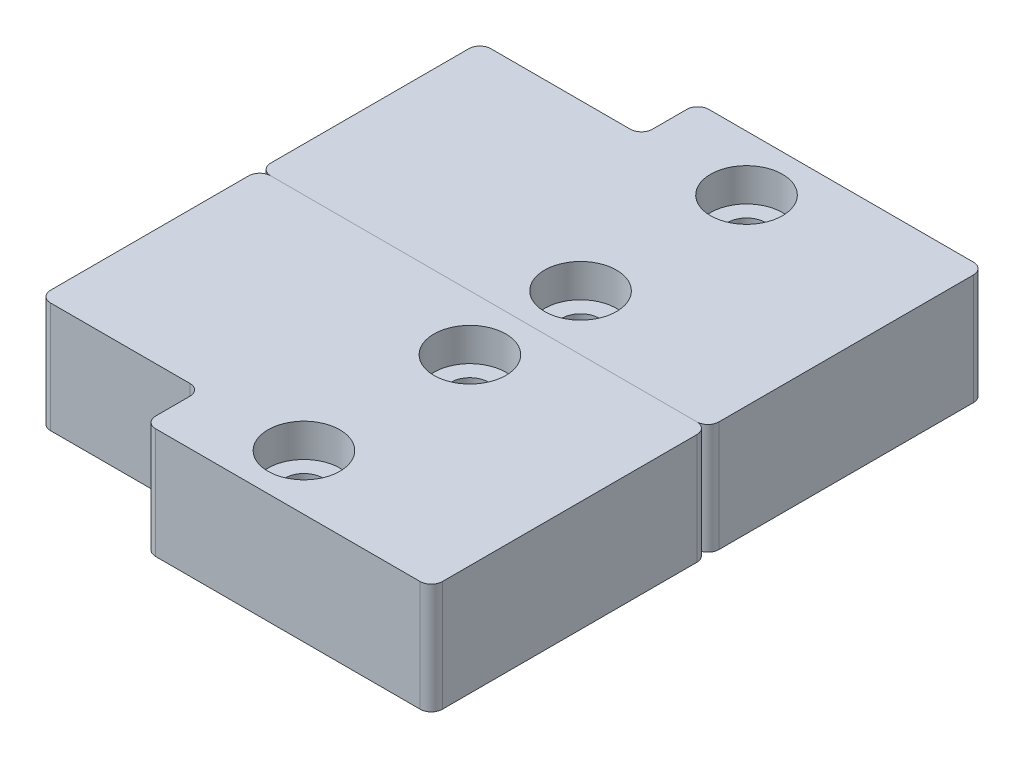
ISO-10303-21;
HEADER;
FILE_DESCRIPTION(('STEP AP214'),'2;1');
FILE_NAME('part.step','',(''),(''),'','','');
FILE_SCHEMA(('AUTOMOTIVE_DESIGN { 1 0 10303 214 1 1 1 1 }'));
ENDSEC;
DATA;
#1=APPLICATION_CONTEXT('core data for automotive mechanical design processes');
#2=APPLICATION_PROTOCOL_DEFINITION('international standard','automotive_design',2000,#1);
#3=PRODUCT_CONTEXT('',#1,'mechanical');
#4=PRODUCT('Part','Part','',(#3));
#5=PRODUCT_RELATED_PRODUCT_CATEGORY('part','',(#4));
#6=PRODUCT_DEFINITION_FORMATION('','',#4);
#7=PRODUCT_DEFINITION_CONTEXT('part definition',#1,'design');
#8=PRODUCT_DEFINITION('design','',#6,#7);
#9=PRODUCT_DEFINITION_SHAPE('','',#8);
#10=(LENGTH_UNIT() NAMED_UNIT(*) SI_UNIT(.MILLI.,.METRE.));
#11=(NAMED_UNIT(*) PLANE_ANGLE_UNIT() SI_UNIT($,.RADIAN.));
#12=(NAMED_UNIT(*) SI_UNIT($,.STERADIAN.) SOLID_ANGLE_UNIT());
#13=UNCERTAINTY_MEASURE_WITH_UNIT(LENGTH_MEASURE(1.E-05),#10,'distance_accuracy_value','');
#14=(GEOMETRIC_REPRESENTATION_CONTEXT(3) GLOBAL_UNCERTAINTY_ASSIGNED_CONTEXT((#13)) GLOBAL_UNIT_ASSIGNED_CONTEXT((#10,
#11,#12)) REPRESENTATION_CONTEXT('',''));
#15=CARTESIAN_POINT('',(0.,0.,0.));
#16=DIRECTION('',(0.,0.,1.));
#17=DIRECTION('',(1.,0.,0.));
#18=AXIS2_PLACEMENT_3D('',#15,#16,#17);
#19=CARTESIAN_POINT('',(0.,10.,19.9));
#20=DIRECTION('',(1.,0.,0.));
#21=DIRECTION('',(0.,0.,1.));
#22=AXIS2_PLACEMENT_3D('',#19,#20,#21);
#23=PLANE('',#22);
#24=DIRECTION('',(0.,0.,-1.));
#25=VECTOR('',#24,1.);
#26=CARTESIAN_POINT('',(0.,10.,19.9));
#27=LINE('',#26,#25);
#28=CARTESIAN_POINT('',(0.,10.,18.9));
#29=VERTEX_POINT('',#28);
#30=CARTESIAN_POINT('',(0.,10.,1.00000000000001));
#31=VERTEX_POINT('',#30);
#32=EDGE_CURVE('E188',#29,#31,#27,.T.);
#33=ORIENTED_EDGE('',*,*,#32,.T.);
#34=DIRECTION('',(0.,-1.,0.));
#35=VECTOR('',#34,1.);
#36=CARTESIAN_POINT('',(0.,10.,1.));
#37=LINE('',#36,#35);
#38=CARTESIAN_POINT('',(0.,0.,1.00000000000001));
#39=VERTEX_POINT('',#38);
#40=EDGE_CURVE('E163',#39,#31,#37,.F.);
#41=ORIENTED_EDGE('',*,*,#40,.F.);
#42=DIRECTION('',(0.,0.,-1.));
#43=VECTOR('',#42,1.);
#44=CARTESIAN_POINT('',(0.,0.,19.9));
#45=LINE('',#44,#43);
#46=CARTESIAN_POINT('',(0.,0.,18.9));
#47=VERTEX_POINT('',#46);
#48=EDGE_CURVE('E145',#47,#39,#45,.T.);
#49=ORIENTED_EDGE('',*,*,#48,.F.);
#50=DIRECTION('',(0.,-1.,0.));
#51=VECTOR('',#50,1.);
#52=CARTESIAN_POINT('',(0.,10.,18.9));
#53=LINE('',#52,#51);
#54=EDGE_CURVE('E156',#29,#47,#53,.T.);
#55=ORIENTED_EDGE('',*,*,#54,.F.);
#56=EDGE_LOOP('',(#33,#41,#49,#55));
#57=FACE_BOUND('',#56,.T.);
#58=ADVANCED_FACE('F53',(#57),#23,.F.);
#59=CARTESIAN_POINT('',(0.,10.,0.));
#60=DIRECTION('',(0.,0.,1.));
#61=DIRECTION('',(-1.,0.,0.));
#62=AXIS2_PLACEMENT_3D('',#59,#60,#61);
#63=PLANE('',#62);
#64=DIRECTION('',(1.,0.,0.));
#65=VECTOR('',#64,1.);
#66=CARTESIAN_POINT('',(0.,0.,0.));
#67=LINE('',#66,#65);
#68=CARTESIAN_POINT('',(1.,0.,0.));
#69=VERTEX_POINT('',#68);
#70=CARTESIAN_POINT('',(39.51,0.,0.));
#71=VERTEX_POINT('',#70);
#72=EDGE_CURVE('E166',#69,#71,#67,.T.);
#73=ORIENTED_EDGE('',*,*,#72,.F.);
#74=DIRECTION('',(0.,-1.,0.));
#75=VECTOR('',#74,1.);
#76=CARTESIAN_POINT('',(1.,10.,0.));
#77=LINE('',#76,#75);
#78=CARTESIAN_POINT('',(1.,10.,0.));
#79=VERTEX_POINT('',#78);
#80=EDGE_CURVE('E223',#79,#69,#77,.T.);
#81=ORIENTED_EDGE('',*,*,#80,.F.);
#82=DIRECTION('',(1.,0.,0.));
#83=VECTOR('',#82,1.);
#84=CARTESIAN_POINT('',(0.,10.,0.));
#85=LINE('',#84,#83);
#86=CARTESIAN_POINT('',(39.51,10.,0.));
#87=VERTEX_POINT('',#86);
#88=EDGE_CURVE('E305',#79,#87,#85,.T.);
#89=ORIENTED_EDGE('',*,*,#88,.T.);
#90=DIRECTION('',(0.,-1.,0.));
#91=VECTOR('',#90,1.);
#92=CARTESIAN_POINT('',(39.51,10.,0.));
#93=LINE('',#92,#91);
#94=EDGE_CURVE('E226',#71,#87,#93,.F.);
#95=ORIENTED_EDGE('',*,*,#94,.F.);
#96=EDGE_LOOP('',(#73,#81,#89,#95));
#97=FACE_BOUND('',#96,.T.);
#98=ADVANCED_FACE('F253',(#97),#63,.F.);
#99=CARTESIAN_POINT('',(40.51,10.,0.));
#100=DIRECTION('',(-1.,0.,0.));
#101=DIRECTION('',(0.,0.,-1.));
#102=AXIS2_PLACEMENT_3D('',#99,#100,#101);
#103=PLANE('',#102);
#104=DIRECTION('',(0.,0.,1.));
#105=VECTOR('',#104,1.);
#106=CARTESIAN_POINT('',(40.51,0.,0.));
#107=LINE('',#106,#105);
#108=CARTESIAN_POINT('',(40.51,0.,1.));
#109=VERTEX_POINT('',#108);
#110=CARTESIAN_POINT('',(40.51,0.,24.));
#111=VERTEX_POINT('',#110);
#112=EDGE_CURVE('E170',#109,#111,#107,.T.);
#113=ORIENTED_EDGE('',*,*,#112,.F.);
#114=DIRECTION('',(0.,-1.,0.));
#115=VECTOR('',#114,1.);
#116=CARTESIAN_POINT('',(40.51,10.,1.));
#117=LINE('',#116,#115);
#118=CARTESIAN_POINT('',(40.51,10.,1.));
#119=VERTEX_POINT('',#118);
#120=EDGE_CURVE('E217',#119,#109,#117,.T.);
#121=ORIENTED_EDGE('',*,*,#120,.F.);
#122=DIRECTION('',(0.,0.,1.));
#123=VECTOR('',#122,1.);
#124=CARTESIAN_POINT('',(40.51,10.,0.));
#125=LINE('',#124,#123);
#126=CARTESIAN_POINT('',(40.51,10.,24.));
#127=VERTEX_POINT('',#126);
#128=EDGE_CURVE('E302',#119,#127,#125,.T.);
#129=ORIENTED_EDGE('',*,*,#128,.T.);
#130=DIRECTION('',(0.,-1.,0.));
#131=VECTOR('',#130,1.);
#132=CARTESIAN_POINT('',(40.51,10.,24.));
#133=LINE('',#132,#131);
#134=EDGE_CURVE('E220',#111,#127,#133,.F.);
#135=ORIENTED_EDGE('',*,*,#134,.F.);
#136=EDGE_LOOP('',(#113,#121,#129,#135));
#137=FACE_BOUND('',#136,.T.);
#138=ADVANCED_FACE('F258',(#137),#103,.F.);
#139=CARTESIAN_POINT('',(40.51,10.,25.));
#140=DIRECTION('',(0.,0.,-1.));
#141=DIRECTION('',(1.,0.,0.));
#142=AXIS2_PLACEMENT_3D('',#139,#140,#141);
#143=PLANE('',#142);
#144=DIRECTION('',(-1.,0.,0.));
#145=VECTOR('',#144,1.);
#146=CARTESIAN_POINT('',(40.51,0.,25.));
#147=LINE('',#146,#145);
#148=CARTESIAN_POINT('',(39.51,0.,25.));
#149=VERTEX_POINT('',#148);
#150=CARTESIAN_POINT('',(15.6,0.,25.));
#151=VERTEX_POINT('',#150);
#152=EDGE_CURVE('E181',#149,#151,#147,.T.);
#153=ORIENTED_EDGE('',*,*,#152,.F.);
#154=DIRECTION('',(0.,-1.,0.));
#155=VECTOR('',#154,1.);
#156=CARTESIAN_POINT('',(39.51,10.,25.));
#157=LINE('',#156,#155);
#158=CARTESIAN_POINT('',(39.51,10.,25.));
#159=VERTEX_POINT('',#158);
#160=EDGE_CURVE('E212',#159,#149,#157,.T.);
#161=ORIENTED_EDGE('',*,*,#160,.F.);
#162=DIRECTION('',(-1.,0.,0.));
#163=VECTOR('',#162,1.);
#164=CARTESIAN_POINT('',(40.51,10.,25.));
#165=LINE('',#164,#163);
#166=CARTESIAN_POINT('',(15.6,10.,25.));
#167=VERTEX_POINT('',#166);
#168=EDGE_CURVE('E304',#159,#167,#165,.T.);
#169=ORIENTED_EDGE('',*,*,#168,.T.);
#170=DIRECTION('',(0.,-1.,0.));
#171=VECTOR('',#170,1.);
#172=CARTESIAN_POINT('',(15.6,10.,25.));
#173=LINE('',#172,#171);
#174=EDGE_CURVE('E215',#151,#167,#173,.F.);
#175=ORIENTED_EDGE('',*,*,#174,.F.);
#176=EDGE_LOOP('',(#153,#161,#169,#175));
#177=FACE_BOUND('',#176,.T.);
#178=ADVANCED_FACE('F285',(#177),#143,.F.);
#179=CARTESIAN_POINT('',(14.6,10.,25.));
#180=DIRECTION('',(1.,0.,0.));
#181=DIRECTION('',(0.,0.,1.));
#182=AXIS2_PLACEMENT_3D('',#179,#180,#181);
#183=PLANE('',#182);
#184=DIRECTION('',(0.,0.,-1.));
#185=VECTOR('',#184,1.);
#186=CARTESIAN_POINT('',(14.6,0.,25.));
#187=LINE('',#186,#185);
#188=CARTESIAN_POINT('',(14.6,0.,24.));
#189=VERTEX_POINT('',#188);
#190=CARTESIAN_POINT('',(14.6,0.,20.9));
#191=VERTEX_POINT('',#190);
#192=EDGE_CURVE('E184',#189,#191,#187,.T.);
#193=ORIENTED_EDGE('',*,*,#192,.F.);
#194=DIRECTION('',(0.,-1.,0.));
#195=VECTOR('',#194,1.);
#196=CARTESIAN_POINT('',(14.6,10.,24.));
#197=LINE('',#196,#195);
#198=CARTESIAN_POINT('',(14.6,10.,24.));
#199=VERTEX_POINT('',#198);
#200=EDGE_CURVE('E208',#199,#189,#197,.T.);
#201=ORIENTED_EDGE('',*,*,#200,.F.);
#202=DIRECTION('',(0.,0.,-1.));
#203=VECTOR('',#202,1.);
#204=CARTESIAN_POINT('',(14.6,10.,25.));
#205=LINE('',#204,#203);
#206=CARTESIAN_POINT('',(14.6,10.,20.9));
#207=VERTEX_POINT('',#206);
#208=EDGE_CURVE('E237',#199,#207,#205,.T.);
#209=ORIENTED_EDGE('',*,*,#208,.T.);
#210=DIRECTION('',(0.,-1.,0.));
#211=VECTOR('',#210,1.);
#212=CARTESIAN_POINT('',(14.6,10.,20.9));
#213=LINE('',#212,#211);
#214=EDGE_CURVE('E210',#191,#207,#213,.F.);
#215=ORIENTED_EDGE('',*,*,#214,.F.);
#216=EDGE_LOOP('',(#193,#201,#209,#215));
#217=FACE_BOUND('',#216,.T.);
#218=ADVANCED_FACE('F235',(#217),#183,.F.);
#219=CARTESIAN_POINT('',(14.6,10.,19.9));
#220=DIRECTION('',(0.,0.,-1.));
#221=DIRECTION('',(1.,0.,0.));
#222=AXIS2_PLACEMENT_3D('',#219,#220,#221);
#223=PLANE('',#222);
#224=DIRECTION('',(-1.,0.,0.));
#225=VECTOR('',#224,1.);
#226=CARTESIAN_POINT('',(14.6,0.,19.9));
#227=LINE('',#226,#225);
#228=CARTESIAN_POINT('',(13.6,0.,19.9));
#229=VERTEX_POINT('',#228);
#230=CARTESIAN_POINT('',(0.999999999999997,0.,19.9));
#231=VERTEX_POINT('',#230);
#232=EDGE_CURVE('E148',#229,#231,#227,.T.);
#233=ORIENTED_EDGE('',*,*,#232,.F.);
#234=DIRECTION('',(0.,-1.,0.));
#235=VECTOR('',#234,1.);
#236=CARTESIAN_POINT('',(13.6,0.,19.9));
#237=LINE('',#236,#235);
#238=CARTESIAN_POINT('',(13.6,10.,19.9));
#239=VERTEX_POINT('',#238);
#240=EDGE_CURVE('E152',#239,#229,#237,.T.);
#241=ORIENTED_EDGE('',*,*,#240,.F.);
#242=DIRECTION('',(-1.,0.,0.));
#243=VECTOR('',#242,1.);
#244=CARTESIAN_POINT('',(14.6,10.,19.9));
#245=LINE('',#244,#243);
#246=CARTESIAN_POINT('',(0.999999999999997,10.,19.9));
#247=VERTEX_POINT('',#246);
#248=EDGE_CURVE('E176',#239,#247,#245,.T.);
#249=ORIENTED_EDGE('',*,*,#248,.T.);
#250=DIRECTION('',(0.,-1.,0.));
#251=VECTOR('',#250,1.);
#252=CARTESIAN_POINT('',(0.999999999999997,10.,19.9));
#253=LINE('',#252,#251);
#254=EDGE_CURVE('E198',#231,#247,#253,.F.);
#255=ORIENTED_EDGE('',*,*,#254,.F.);
#256=EDGE_LOOP('',(#233,#241,#249,#255));
#257=FACE_BOUND('',#256,.T.);
#258=ADVANCED_FACE('F273',(#257),#223,.F.);
#259=CARTESIAN_POINT('',(0.,10.,0.));
#260=DIRECTION('',(0.,1.,0.));
#261=DIRECTION('',(0.,0.,-1.));
#262=AXIS2_PLACEMENT_3D('',#259,#260,#261);
#263=PLANE('',#262);
#264=CARTESIAN_POINT('',(24.,10.,20.));
#265=DIRECTION('',(0.,-1.,0.));
#266=DIRECTION('',(0.,0.,-1.));
#267=AXIS2_PLACEMENT_3D('',#264,#265,#266);
#268=CIRCLE('',#267,3.25);
#269=CARTESIAN_POINT('',(24.,10.,16.75));
#270=VERTEX_POINT('',#269);
#271=EDGE_CURVE('E330',#270,#270,#268,.T.);
#272=ORIENTED_EDGE('',*,*,#271,.T.);
#273=EDGE_LOOP('',(#272));
#274=FACE_BOUND('',#273,.T.);
#275=CARTESIAN_POINT('',(24.,10.,5.));
#276=DIRECTION('',(0.,-1.,0.));
#277=DIRECTION('',(0.,0.,-1.));
#278=AXIS2_PLACEMENT_3D('',#275,#276,#277);
#279=CIRCLE('',#278,3.25);
#280=CARTESIAN_POINT('',(24.,10.,1.75000000000001));
#281=VERTEX_POINT('',#280);
#282=EDGE_CURVE('E318',#281,#281,#279,.T.);
#283=ORIENTED_EDGE('',*,*,#282,.T.);
#284=EDGE_LOOP('',(#283));
#285=FACE_BOUND('',#284,.T.);
#286=ORIENTED_EDGE('',*,*,#248,.F.);
#287=CARTESIAN_POINT('',(13.6,10.,20.9));
#288=DIRECTION('',(0.,-1.,0.));
#289=DIRECTION('',(0.,0.,-1.));
#290=AXIS2_PLACEMENT_3D('',#287,#288,#289);
#291=CIRCLE('',#290,1.);
#292=EDGE_CURVE('E12',#207,#239,#291,.F.);
#293=ORIENTED_EDGE('',*,*,#292,.F.);
#294=ORIENTED_EDGE('',*,*,#208,.F.);
#295=CARTESIAN_POINT('',(15.6,10.,24.));
#296=DIRECTION('',(0.,-1.,0.));
#297=DIRECTION('',(0.,0.,-1.));
#298=AXIS2_PLACEMENT_3D('',#295,#296,#297);
#299=CIRCLE('',#298,1.);
#300=EDGE_CURVE('E74',#167,#199,#299,.T.);
#301=ORIENTED_EDGE('',*,*,#300,.F.);
#302=ORIENTED_EDGE('',*,*,#168,.F.);
#303=CARTESIAN_POINT('',(39.51,10.,24.));
#304=DIRECTION('',(0.,-1.,0.));
#305=DIRECTION('',(0.,0.,-1.));
#306=AXIS2_PLACEMENT_3D('',#303,#304,#305);
#307=CIRCLE('',#306,1.);
#308=EDGE_CURVE('E204',#127,#159,#307,.T.);
#309=ORIENTED_EDGE('',*,*,#308,.F.);
#310=ORIENTED_EDGE('',*,*,#128,.F.);
#311=CARTESIAN_POINT('',(39.51,10.,1.));
#312=DIRECTION('',(0.,-1.,0.));
#313=DIRECTION('',(0.,0.,-1.));
#314=AXIS2_PLACEMENT_3D('',#311,#312,#313);
#315=CIRCLE('',#314,1.);
#316=EDGE_CURVE('E202',#87,#119,#315,.T.);
#317=ORIENTED_EDGE('',*,*,#316,.F.);
#318=ORIENTED_EDGE('',*,*,#88,.F.);
#319=CARTESIAN_POINT('',(1.,10.,1.));
#320=DIRECTION('',(0.,-1.,0.));
#321=DIRECTION('',(0.,0.,-1.));
#322=AXIS2_PLACEMENT_3D('',#319,#320,#321);
#323=CIRCLE('',#322,1.);
#324=EDGE_CURVE('E200',#31,#79,#323,.T.);
#325=ORIENTED_EDGE('',*,*,#324,.F.);
#326=ORIENTED_EDGE('',*,*,#32,.F.);
#327=CARTESIAN_POINT('',(0.999999999999998,10.,18.9));
#328=DIRECTION('',(0.,-1.,0.));
#329=DIRECTION('',(0.,0.,-1.));
#330=AXIS2_PLACEMENT_3D('',#327,#328,#329);
#331=CIRCLE('',#330,1.);
#332=EDGE_CURVE('E158',#247,#29,#331,.T.);
#333=ORIENTED_EDGE('',*,*,#332,.F.);
#334=EDGE_LOOP('',(#286,#293,#294,#301,#302,#309,#310,#317,#318,#325,#326,#333));
#335=FACE_BOUND('',#334,.T.);
#336=ADVANCED_FACE('F267',(#274,#285,#335),#263,.T.);
#337=CARTESIAN_POINT('',(0.,0.,0.));
#338=DIRECTION('',(0.,1.,0.));
#339=DIRECTION('',(0.,0.,-1.));
#340=AXIS2_PLACEMENT_3D('',#337,#338,#339);
#341=PLANE('',#340);
#342=CARTESIAN_POINT('',(24.,0.,20.));
#343=DIRECTION('',(0.,-1.,0.));
#344=DIRECTION('',(0.,0.,-1.));
#345=AXIS2_PLACEMENT_3D('',#342,#343,#344);
#346=CIRCLE('',#345,1.7);
#347=CARTESIAN_POINT('',(24.,0.,18.3));
#348=VERTEX_POINT('',#347);
#349=EDGE_CURVE('E321',#348,#348,#346,.T.);
#350=ORIENTED_EDGE('',*,*,#349,.F.);
#351=EDGE_LOOP('',(#350));
#352=FACE_BOUND('',#351,.T.);
#353=CARTESIAN_POINT('',(24.,0.,5.));
#354=DIRECTION('',(0.,-1.,0.));
#355=DIRECTION('',(0.,0.,-1.));
#356=AXIS2_PLACEMENT_3D('',#353,#354,#355);
#357=CIRCLE('',#356,1.7);
#358=CARTESIAN_POINT('',(24.,0.,3.3));
#359=VERTEX_POINT('',#358);
#360=EDGE_CURVE('E167',#359,#359,#357,.T.);
#361=ORIENTED_EDGE('',*,*,#360,.F.);
#362=EDGE_LOOP('',(#361));
#363=FACE_BOUND('',#362,.T.);
#364=ORIENTED_EDGE('',*,*,#48,.T.);
#365=CARTESIAN_POINT('',(1.,0.,1.));
#366=DIRECTION('',(0.,-1.,0.));
#367=DIRECTION('',(0.,0.,-1.));
#368=AXIS2_PLACEMENT_3D('',#365,#366,#367);
#369=CIRCLE('',#368,1.);
#370=EDGE_CURVE('E162',#69,#39,#369,.F.);
#371=ORIENTED_EDGE('',*,*,#370,.F.);
#372=ORIENTED_EDGE('',*,*,#72,.T.);
#373=CARTESIAN_POINT('',(39.51,0.,1.));
#374=DIRECTION('',(0.,-1.,0.));
#375=DIRECTION('',(0.,0.,-1.));
#376=AXIS2_PLACEMENT_3D('',#373,#374,#375);
#377=CIRCLE('',#376,1.);
#378=EDGE_CURVE('E191',#109,#71,#377,.F.);
#379=ORIENTED_EDGE('',*,*,#378,.F.);
#380=ORIENTED_EDGE('',*,*,#112,.T.);
#381=CARTESIAN_POINT('',(39.51,0.,24.));
#382=DIRECTION('',(0.,-1.,0.));
#383=DIRECTION('',(0.,0.,-1.));
#384=AXIS2_PLACEMENT_3D('',#381,#382,#383);
#385=CIRCLE('',#384,1.);
#386=EDGE_CURVE('E193',#149,#111,#385,.F.);
#387=ORIENTED_EDGE('',*,*,#386,.F.);
#388=ORIENTED_EDGE('',*,*,#152,.T.);
#389=CARTESIAN_POINT('',(15.6,0.,24.));
#390=DIRECTION('',(0.,-1.,0.));
#391=DIRECTION('',(0.,0.,-1.));
#392=AXIS2_PLACEMENT_3D('',#389,#390,#391);
#393=CIRCLE('',#392,1.);
#394=EDGE_CURVE('E153',#189,#151,#393,.F.);
#395=ORIENTED_EDGE('',*,*,#394,.F.);
#396=ORIENTED_EDGE('',*,*,#192,.T.);
#397=CARTESIAN_POINT('',(13.6,0.,20.9));
#398=DIRECTION('',(0.,-1.,0.));
#399=DIRECTION('',(0.,0.,-1.));
#400=AXIS2_PLACEMENT_3D('',#397,#398,#399);
#401=CIRCLE('',#400,1.);
#402=EDGE_CURVE('E61',#229,#191,#401,.T.);
#403=ORIENTED_EDGE('',*,*,#402,.F.);
#404=ORIENTED_EDGE('',*,*,#232,.T.);
#405=CARTESIAN_POINT('',(0.999999999999998,0.,18.9));
#406=DIRECTION('',(0.,-1.,0.));
#407=DIRECTION('',(0.,0.,-1.));
#408=AXIS2_PLACEMENT_3D('',#405,#406,#407);
#409=CIRCLE('',#408,1.);
#410=EDGE_CURVE('E141',#47,#231,#409,.F.);
#411=ORIENTED_EDGE('',*,*,#410,.F.);
#412=EDGE_LOOP('',(#364,#371,#372,#379,#380,#387,#388,#395,#396,#403,#404,#411));
#413=FACE_BOUND('',#412,.T.);
#414=ADVANCED_FACE('F143',(#352,#363,#413),#341,.F.);
#415=CARTESIAN_POINT('',(0.999999999999998,10.,18.9));
#416=DIRECTION('',(0.,-1.,0.));
#417=DIRECTION('',(0.,0.,1.));
#418=AXIS2_PLACEMENT_3D('',#415,#416,#417);
#419=CYLINDRICAL_SURFACE('',#418,1.);
#420=ORIENTED_EDGE('',*,*,#332,.T.);
#421=ORIENTED_EDGE('',*,*,#54,.T.);
#422=ORIENTED_EDGE('',*,*,#410,.T.);
#423=ORIENTED_EDGE('',*,*,#254,.T.);
#424=EDGE_LOOP('',(#420,#421,#422,#423));
#425=FACE_BOUND('',#424,.T.);
#426=ADVANCED_FACE('F157',(#425),#419,.T.);
#427=CARTESIAN_POINT('',(13.6,10.,20.9));
#428=DIRECTION('',(0.,1.,0.));
#429=DIRECTION('',(0.,0.,-1.));
#430=AXIS2_PLACEMENT_3D('',#427,#428,#429);
#431=CYLINDRICAL_SURFACE('',#430,1.);
#432=ORIENTED_EDGE('',*,*,#292,.T.);
#433=ORIENTED_EDGE('',*,*,#240,.T.);
#434=ORIENTED_EDGE('',*,*,#402,.T.);
#435=ORIENTED_EDGE('',*,*,#214,.T.);
#436=EDGE_LOOP('',(#432,#433,#434,#435));
#437=FACE_BOUND('',#436,.T.);
#438=ADVANCED_FACE('F230',(#437),#431,.F.);
#439=CARTESIAN_POINT('',(15.6,10.,24.));
#440=DIRECTION('',(0.,-1.,0.));
#441=DIRECTION('',(0.,0.,1.));
#442=AXIS2_PLACEMENT_3D('',#439,#440,#441);
#443=CYLINDRICAL_SURFACE('',#442,1.);
#444=ORIENTED_EDGE('',*,*,#300,.T.);
#445=ORIENTED_EDGE('',*,*,#200,.T.);
#446=ORIENTED_EDGE('',*,*,#394,.T.);
#447=ORIENTED_EDGE('',*,*,#174,.T.);
#448=EDGE_LOOP('',(#444,#445,#446,#447));
#449=FACE_BOUND('',#448,.T.);
#450=ADVANCED_FACE('F240',(#449),#443,.T.);
#451=CARTESIAN_POINT('',(39.51,10.,24.));
#452=DIRECTION('',(0.,-1.,0.));
#453=DIRECTION('',(0.,0.,1.));
#454=AXIS2_PLACEMENT_3D('',#451,#452,#453);
#455=CYLINDRICAL_SURFACE('',#454,1.);
#456=ORIENTED_EDGE('',*,*,#308,.T.);
#457=ORIENTED_EDGE('',*,*,#160,.T.);
#458=ORIENTED_EDGE('',*,*,#386,.T.);
#459=ORIENTED_EDGE('',*,*,#134,.T.);
#460=EDGE_LOOP('',(#456,#457,#458,#459));
#461=FACE_BOUND('',#460,.T.);
#462=ADVANCED_FACE('F242',(#461),#455,.T.);
#463=CARTESIAN_POINT('',(39.51,10.,1.));
#464=DIRECTION('',(0.,-1.,0.));
#465=DIRECTION('',(0.,0.,1.));
#466=AXIS2_PLACEMENT_3D('',#463,#464,#465);
#467=CYLINDRICAL_SURFACE('',#466,1.);
#468=ORIENTED_EDGE('',*,*,#316,.T.);
#469=ORIENTED_EDGE('',*,*,#120,.T.);
#470=ORIENTED_EDGE('',*,*,#378,.T.);
#471=ORIENTED_EDGE('',*,*,#94,.T.);
#472=EDGE_LOOP('',(#468,#469,#470,#471));
#473=FACE_BOUND('',#472,.T.);
#474=ADVANCED_FACE('F248',(#473),#467,.T.);
#475=CARTESIAN_POINT('',(1.,10.,1.));
#476=DIRECTION('',(0.,-1.,0.));
#477=DIRECTION('',(0.,0.,1.));
#478=AXIS2_PLACEMENT_3D('',#475,#476,#477);
#479=CYLINDRICAL_SURFACE('',#478,1.);
#480=ORIENTED_EDGE('',*,*,#324,.T.);
#481=ORIENTED_EDGE('',*,*,#80,.T.);
#482=ORIENTED_EDGE('',*,*,#370,.T.);
#483=ORIENTED_EDGE('',*,*,#40,.T.);
#484=EDGE_LOOP('',(#480,#481,#482,#483));
#485=FACE_BOUND('',#484,.T.);
#486=ADVANCED_FACE('F55',(#485),#479,.T.);
#487=CARTESIAN_POINT('',(24.,10.,5.));
#488=DIRECTION('',(0.,1.,0.));
#489=DIRECTION('',(0.,0.,-1.));
#490=AXIS2_PLACEMENT_3D('',#487,#488,#489);
#491=CYLINDRICAL_SURFACE('',#490,1.7);
#492=ORIENTED_EDGE('',*,*,#360,.T.);
#493=EDGE_LOOP('',(#492));
#494=FACE_BOUND('',#493,.T.);
#495=CARTESIAN_POINT('',(24.,7.,5.));
#496=DIRECTION('',(0.,-1.,0.));
#497=DIRECTION('',(0.,0.,-1.));
#498=AXIS2_PLACEMENT_3D('',#495,#496,#497);
#499=CIRCLE('',#498,1.7);
#500=CARTESIAN_POINT('',(24.,7.,3.3));
#501=VERTEX_POINT('',#500);
#502=EDGE_CURVE('E173',#501,#501,#499,.T.);
#503=ORIENTED_EDGE('',*,*,#502,.F.);
#504=EDGE_LOOP('',(#503));
#505=FACE_BOUND('',#504,.T.);
#506=ADVANCED_FACE('F356',(#494,#505),#491,.F.);
#507=CARTESIAN_POINT('',(25.7,7.,5.));
#508=DIRECTION('',(0.,-1.,0.));
#509=DIRECTION('',(0.,0.,1.));
#510=AXIS2_PLACEMENT_3D('',#507,#508,#509);
#511=PLANE('',#510);
#512=ORIENTED_EDGE('',*,*,#502,.T.);
#513=EDGE_LOOP('',(#512));
#514=FACE_BOUND('',#513,.T.);
#515=CARTESIAN_POINT('',(24.,7.,5.));
#516=DIRECTION('',(0.,-1.,0.));
#517=DIRECTION('',(0.,0.,-1.));
#518=AXIS2_PLACEMENT_3D('',#515,#516,#517);
#519=CIRCLE('',#518,3.25);
#520=CARTESIAN_POINT('',(24.,7.,1.75000000000001));
#521=VERTEX_POINT('',#520);
#522=EDGE_CURVE('E315',#521,#521,#519,.T.);
#523=ORIENTED_EDGE('',*,*,#522,.F.);
#524=EDGE_LOOP('',(#523));
#525=FACE_BOUND('',#524,.T.);
#526=ADVANCED_FACE('F353',(#514,#525),#511,.F.);
#527=CARTESIAN_POINT('',(24.,10.,5.));
#528=DIRECTION('',(0.,1.,0.));
#529=DIRECTION('',(0.,0.,-1.));
#530=AXIS2_PLACEMENT_3D('',#527,#528,#529);
#531=CYLINDRICAL_SURFACE('',#530,3.25);
#532=ORIENTED_EDGE('',*,*,#522,.T.);
#533=EDGE_LOOP('',(#532));
#534=FACE_BOUND('',#533,.T.);
#535=ORIENTED_EDGE('',*,*,#282,.F.);
#536=EDGE_LOOP('',(#535));
#537=FACE_BOUND('',#536,.T.);
#538=ADVANCED_FACE('F349',(#534,#537),#531,.F.);
#539=CARTESIAN_POINT('',(24.,10.,20.));
#540=DIRECTION('',(0.,1.,0.));
#541=DIRECTION('',(0.,0.,-1.));
#542=AXIS2_PLACEMENT_3D('',#539,#540,#541);
#543=CYLINDRICAL_SURFACE('',#542,1.7);
#544=ORIENTED_EDGE('',*,*,#349,.T.);
#545=EDGE_LOOP('',(#544));
#546=FACE_BOUND('',#545,.T.);
#547=CARTESIAN_POINT('',(24.,7.,20.));
#548=DIRECTION('',(0.,-1.,0.));
#549=DIRECTION('',(0.,0.,-1.));
#550=AXIS2_PLACEMENT_3D('',#547,#548,#549);
#551=CIRCLE('',#550,1.7);
#552=CARTESIAN_POINT('',(24.,7.,18.3));
#553=VERTEX_POINT('',#552);
#554=EDGE_CURVE('E324',#553,#553,#551,.T.);
#555=ORIENTED_EDGE('',*,*,#554,.F.);
#556=EDGE_LOOP('',(#555));
#557=FACE_BOUND('',#556,.T.);
#558=ADVANCED_FACE('F343',(#546,#557),#543,.F.);
#559=CARTESIAN_POINT('',(25.7,7.,20.));
#560=DIRECTION('',(0.,-1.,0.));
#561=DIRECTION('',(0.,0.,1.));
#562=AXIS2_PLACEMENT_3D('',#559,#560,#561);
#563=PLANE('',#562);
#564=ORIENTED_EDGE('',*,*,#554,.T.);
#565=EDGE_LOOP('',(#564));
#566=FACE_BOUND('',#565,.T.);
#567=CARTESIAN_POINT('',(24.,7.,20.));
#568=DIRECTION('',(0.,-1.,0.));
#569=DIRECTION('',(0.,0.,-1.));
#570=AXIS2_PLACEMENT_3D('',#567,#568,#569);
#571=CIRCLE('',#570,3.25);
#572=CARTESIAN_POINT('',(24.,7.,16.75));
#573=VERTEX_POINT('',#572);
#574=EDGE_CURVE('E327',#573,#573,#571,.T.);
#575=ORIENTED_EDGE('',*,*,#574,.F.);
#576=EDGE_LOOP('',(#575));
#577=FACE_BOUND('',#576,.T.);
#578=ADVANCED_FACE('F337',(#566,#577),#563,.F.);
#579=CARTESIAN_POINT('',(24.,10.,20.));
#580=DIRECTION('',(0.,1.,0.));
#581=DIRECTION('',(0.,0.,-1.));
#582=AXIS2_PLACEMENT_3D('',#579,#580,#581);
#583=CYLINDRICAL_SURFACE('',#582,3.25);
#584=ORIENTED_EDGE('',*,*,#574,.T.);
#585=EDGE_LOOP('',(#584));
#586=FACE_BOUND('',#585,.T.);
#587=ORIENTED_EDGE('',*,*,#271,.F.);
#588=EDGE_LOOP('',(#587));
#589=FACE_BOUND('',#588,.T.);
#590=ADVANCED_FACE('F335',(#586,#589),#583,.F.);
#591=CLOSED_SHELL('',(#58,#98,#138,#178,#218,#258,#336,#414,#426,#438,#450,#462,#474,#486,#506,
#526,#538,#558,#578,#590));
#592=MANIFOLD_SOLID_BREP('B2',#591);
#593=CARTESIAN_POINT('',(0.,10.,-19.9));
#594=DIRECTION('',(1.,0.,0.));
#595=DIRECTION('',(0.,0.,-1.));
#596=AXIS2_PLACEMENT_3D('',#593,#594,#595);
#597=PLANE('',#596);
#598=DIRECTION('',(0.,0.,1.));
#599=VECTOR('',#598,1.);
#600=CARTESIAN_POINT('',(0.,10.,-19.9));
#601=LINE('',#600,#599);
#602=CARTESIAN_POINT('',(0.,10.,-18.9));
#603=VERTEX_POINT('',#602);
#604=CARTESIAN_POINT('',(0.,10.,-1.00000000000001));
#605=VERTEX_POINT('',#604);
#606=EDGE_CURVE('E636',#603,#605,#601,.T.);
#607=ORIENTED_EDGE('',*,*,#606,.F.);
#608=DIRECTION('',(0.,-1.,0.));
#609=VECTOR('',#608,1.);
#610=CARTESIAN_POINT('',(0.,10.,-18.9));
#611=LINE('',#610,#609);
#612=CARTESIAN_POINT('',(0.,0.,-18.9));
#613=VERTEX_POINT('',#612);
#614=EDGE_CURVE('E621',#603,#613,#611,.T.);
#615=ORIENTED_EDGE('',*,*,#614,.T.);
#616=DIRECTION('',(0.,0.,1.));
#617=VECTOR('',#616,1.);
#618=CARTESIAN_POINT('',(0.,0.,-19.9));
#619=LINE('',#618,#617);
#620=CARTESIAN_POINT('',(0.,0.,-1.00000000000001));
#621=VERTEX_POINT('',#620);
#622=EDGE_CURVE('E633',#613,#621,#619,.T.);
#623=ORIENTED_EDGE('',*,*,#622,.T.);
#624=DIRECTION('',(0.,-1.,0.));
#625=VECTOR('',#624,1.);
#626=CARTESIAN_POINT('',(0.,10.,-1.));
#627=LINE('',#626,#625);
#628=EDGE_CURVE('E638',#621,#605,#627,.F.);
#629=ORIENTED_EDGE('',*,*,#628,.T.);
#630=EDGE_LOOP('',(#607,#615,#623,#629));
#631=FACE_BOUND('',#630,.T.);
#632=ADVANCED_FACE('F527',(#631),#597,.F.);
#633=CARTESIAN_POINT('',(0.,10.,0.));
#634=DIRECTION('',(0.,0.,-1.));
#635=DIRECTION('',(-1.,0.,0.));
#636=AXIS2_PLACEMENT_3D('',#633,#634,#635);
#637=PLANE('',#636);
#638=DIRECTION('',(1.,0.,0.));
#639=VECTOR('',#638,1.);
#640=CARTESIAN_POINT('',(0.,0.,0.));
#641=LINE('',#640,#639);
#642=CARTESIAN_POINT('',(1.,0.,0.));
#643=VERTEX_POINT('',#642);
#644=CARTESIAN_POINT('',(39.51,0.,0.));
#645=VERTEX_POINT('',#644);
#646=EDGE_CURVE('E642',#643,#645,#641,.T.);
#647=ORIENTED_EDGE('',*,*,#646,.T.);
#648=DIRECTION('',(0.,-1.,0.));
#649=VECTOR('',#648,1.);
#650=CARTESIAN_POINT('',(39.51,10.,0.));
#651=LINE('',#650,#649);
#652=CARTESIAN_POINT('',(39.51,10.,0.));
#653=VERTEX_POINT('',#652);
#654=EDGE_CURVE('E700',#645,#653,#651,.F.);
#655=ORIENTED_EDGE('',*,*,#654,.T.);
#656=DIRECTION('',(1.,0.,0.));
#657=VECTOR('',#656,1.);
#658=CARTESIAN_POINT('',(0.,10.,0.));
#659=LINE('',#658,#657);
#660=CARTESIAN_POINT('',(1.,10.,0.));
#661=VERTEX_POINT('',#660);
#662=EDGE_CURVE('E720',#661,#653,#659,.T.);
#663=ORIENTED_EDGE('',*,*,#662,.F.);
#664=DIRECTION('',(0.,-1.,0.));
#665=VECTOR('',#664,1.);
#666=CARTESIAN_POINT('',(1.,10.,0.));
#667=LINE('',#666,#665);
#668=EDGE_CURVE('E697',#661,#643,#667,.T.);
#669=ORIENTED_EDGE('',*,*,#668,.T.);
#670=EDGE_LOOP('',(#647,#655,#663,#669));
#671=FACE_BOUND('',#670,.T.);
#672=ADVANCED_FACE('F770',(#671),#637,.F.);
#673=CARTESIAN_POINT('',(40.51,10.,0.));
#674=DIRECTION('',(-1.,0.,0.));
#675=DIRECTION('',(0.,0.,1.));
#676=AXIS2_PLACEMENT_3D('',#673,#674,#675);
#677=PLANE('',#676);
#678=DIRECTION('',(0.,0.,-1.));
#679=VECTOR('',#678,1.);
#680=CARTESIAN_POINT('',(40.51,0.,0.));
#681=LINE('',#680,#679);
#682=CARTESIAN_POINT('',(40.51,0.,-1.));
#683=VERTEX_POINT('',#682);
#684=CARTESIAN_POINT('',(40.51,0.,-24.));
#685=VERTEX_POINT('',#684);
#686=EDGE_CURVE('E646',#683,#685,#681,.T.);
#687=ORIENTED_EDGE('',*,*,#686,.T.);
#688=DIRECTION('',(0.,-1.,0.));
#689=VECTOR('',#688,1.);
#690=CARTESIAN_POINT('',(40.51,10.,-24.));
#691=LINE('',#690,#689);
#692=CARTESIAN_POINT('',(40.51,10.,-24.));
#693=VERTEX_POINT('',#692);
#694=EDGE_CURVE('E695',#685,#693,#691,.F.);
#695=ORIENTED_EDGE('',*,*,#694,.T.);
#696=DIRECTION('',(0.,0.,-1.));
#697=VECTOR('',#696,1.);
#698=CARTESIAN_POINT('',(40.51,10.,0.));
#699=LINE('',#698,#697);
#700=CARTESIAN_POINT('',(40.51,10.,-1.));
#701=VERTEX_POINT('',#700);
#702=EDGE_CURVE('E715',#701,#693,#699,.T.);
#703=ORIENTED_EDGE('',*,*,#702,.F.);
#704=DIRECTION('',(0.,-1.,0.));
#705=VECTOR('',#704,1.);
#706=CARTESIAN_POINT('',(40.51,10.,-1.));
#707=LINE('',#706,#705);
#708=EDGE_CURVE('E692',#701,#683,#707,.T.);
#709=ORIENTED_EDGE('',*,*,#708,.T.);
#710=EDGE_LOOP('',(#687,#695,#703,#709));
#711=FACE_BOUND('',#710,.T.);
#712=ADVANCED_FACE('F775',(#711),#677,.F.);
#713=CARTESIAN_POINT('',(40.51,10.,-25.));
#714=DIRECTION('',(0.,0.,1.));
#715=DIRECTION('',(1.,0.,0.));
#716=AXIS2_PLACEMENT_3D('',#713,#714,#715);
#717=PLANE('',#716);
#718=DIRECTION('',(-1.,0.,0.));
#719=VECTOR('',#718,1.);
#720=CARTESIAN_POINT('',(40.51,0.,-25.));
#721=LINE('',#720,#719);
#722=CARTESIAN_POINT('',(39.51,0.,-25.));
#723=VERTEX_POINT('',#722);
#724=CARTESIAN_POINT('',(15.6,0.,-25.));
#725=VERTEX_POINT('',#724);
#726=EDGE_CURVE('E657',#723,#725,#721,.T.);
#727=ORIENTED_EDGE('',*,*,#726,.T.);
#728=DIRECTION('',(0.,-1.,0.));
#729=VECTOR('',#728,1.);
#730=CARTESIAN_POINT('',(15.6,10.,-25.));
#731=LINE('',#730,#729);
#732=CARTESIAN_POINT('',(15.6,10.,-25.));
#733=VERTEX_POINT('',#732);
#734=EDGE_CURVE('E690',#725,#733,#731,.F.);
#735=ORIENTED_EDGE('',*,*,#734,.T.);
#736=DIRECTION('',(-1.,0.,0.));
#737=VECTOR('',#736,1.);
#738=CARTESIAN_POINT('',(40.51,10.,-25.));
#739=LINE('',#738,#737);
#740=CARTESIAN_POINT('',(39.51,10.,-25.));
#741=VERTEX_POINT('',#740);
#742=EDGE_CURVE('E714',#741,#733,#739,.T.);
#743=ORIENTED_EDGE('',*,*,#742,.F.);
#744=DIRECTION('',(0.,-1.,0.));
#745=VECTOR('',#744,1.);
#746=CARTESIAN_POINT('',(39.51,10.,-25.));
#747=LINE('',#746,#745);
#748=EDGE_CURVE('E687',#741,#723,#747,.T.);
#749=ORIENTED_EDGE('',*,*,#748,.T.);
#750=EDGE_LOOP('',(#727,#735,#743,#749));
#751=FACE_BOUND('',#750,.T.);
#752=ADVANCED_FACE('F810',(#751),#717,.F.);
#753=CARTESIAN_POINT('',(14.6,10.,-25.));
#754=DIRECTION('',(1.,0.,0.));
#755=DIRECTION('',(0.,0.,-1.));
#756=AXIS2_PLACEMENT_3D('',#753,#754,#755);
#757=PLANE('',#756);
#758=DIRECTION('',(0.,0.,1.));
#759=VECTOR('',#758,1.);
#760=CARTESIAN_POINT('',(14.6,0.,-25.));
#761=LINE('',#760,#759);
#762=CARTESIAN_POINT('',(14.6,0.,-24.));
#763=VERTEX_POINT('',#762);
#764=CARTESIAN_POINT('',(14.6,0.,-20.9));
#765=VERTEX_POINT('',#764);
#766=EDGE_CURVE('E660',#763,#765,#761,.T.);
#767=ORIENTED_EDGE('',*,*,#766,.T.);
#768=DIRECTION('',(0.,-1.,0.));
#769=VECTOR('',#768,1.);
#770=CARTESIAN_POINT('',(14.6,10.,-20.9));
#771=LINE('',#770,#769);
#772=CARTESIAN_POINT('',(14.6,10.,-20.9));
#773=VERTEX_POINT('',#772);
#774=EDGE_CURVE('E542',#765,#773,#771,.F.);
#775=ORIENTED_EDGE('',*,*,#774,.T.);
#776=DIRECTION('',(0.,0.,1.));
#777=VECTOR('',#776,1.);
#778=CARTESIAN_POINT('',(14.6,10.,-25.));
#779=LINE('',#778,#777);
#780=CARTESIAN_POINT('',(14.6,10.,-24.));
#781=VERTEX_POINT('',#780);
#782=EDGE_CURVE('E711',#781,#773,#779,.T.);
#783=ORIENTED_EDGE('',*,*,#782,.F.);
#784=DIRECTION('',(0.,-1.,0.));
#785=VECTOR('',#784,1.);
#786=CARTESIAN_POINT('',(14.6,10.,-24.));
#787=LINE('',#786,#785);
#788=EDGE_CURVE('E683',#781,#763,#787,.T.);
#789=ORIENTED_EDGE('',*,*,#788,.T.);
#790=EDGE_LOOP('',(#767,#775,#783,#789));
#791=FACE_BOUND('',#790,.T.);
#792=ADVANCED_FACE('F704',(#791),#757,.F.);
#793=CARTESIAN_POINT('',(14.6,10.,-19.9));
#794=DIRECTION('',(0.,0.,1.));
#795=DIRECTION('',(1.,0.,0.));
#796=AXIS2_PLACEMENT_3D('',#793,#794,#795);
#797=PLANE('',#796);
#798=DIRECTION('',(-1.,0.,0.));
#799=VECTOR('',#798,1.);
#800=CARTESIAN_POINT('',(14.6,0.,-19.9));
#801=LINE('',#800,#799);
#802=CARTESIAN_POINT('',(13.6,0.,-19.9));
#803=VERTEX_POINT('',#802);
#804=CARTESIAN_POINT('',(0.999999999999997,0.,-19.9));
#805=VERTEX_POINT('',#804);
#806=EDGE_CURVE('E662',#803,#805,#801,.T.);
#807=ORIENTED_EDGE('',*,*,#806,.T.);
#808=DIRECTION('',(0.,-1.,0.));
#809=VECTOR('',#808,1.);
#810=CARTESIAN_POINT('',(0.999999999999997,10.,-19.9));
#811=LINE('',#810,#809);
#812=CARTESIAN_POINT('',(0.999999999999997,10.,-19.9));
#813=VERTEX_POINT('',#812);
#814=EDGE_CURVE('E622',#805,#813,#811,.F.);
#815=ORIENTED_EDGE('',*,*,#814,.T.);
#816=DIRECTION('',(-1.,0.,0.));
#817=VECTOR('',#816,1.);
#818=CARTESIAN_POINT('',(14.6,10.,-19.9));
#819=LINE('',#818,#817);
#820=CARTESIAN_POINT('',(13.6,10.,-19.9));
#821=VERTEX_POINT('',#820);
#822=EDGE_CURVE('E652',#821,#813,#819,.T.);
#823=ORIENTED_EDGE('',*,*,#822,.F.);
#824=DIRECTION('',(0.,-1.,0.));
#825=VECTOR('',#824,1.);
#826=CARTESIAN_POINT('',(13.6,0.,-19.9));
#827=LINE('',#826,#825);
#828=EDGE_CURVE('E627',#821,#803,#827,.T.);
#829=ORIENTED_EDGE('',*,*,#828,.T.);
#830=EDGE_LOOP('',(#807,#815,#823,#829));
#831=FACE_BOUND('',#830,.T.);
#832=ADVANCED_FACE('F713',(#831),#797,.F.);
#833=CARTESIAN_POINT('',(0.,10.,0.));
#834=DIRECTION('',(0.,1.,0.));
#835=DIRECTION('',(0.,0.,1.));
#836=AXIS2_PLACEMENT_3D('',#833,#834,#835);
#837=PLANE('',#836);
#838=CARTESIAN_POINT('',(24.,10.,-20.));
#839=DIRECTION('',(0.,1.,0.));
#840=DIRECTION('',(0.,0.,1.));
#841=AXIS2_PLACEMENT_3D('',#838,#839,#840);
#842=CIRCLE('',#841,3.25);
#843=CARTESIAN_POINT('',(24.,10.,-16.75));
#844=VERTEX_POINT('',#843);
#845=EDGE_CURVE('E741',#844,#844,#842,.T.);
#846=ORIENTED_EDGE('',*,*,#845,.F.);
#847=EDGE_LOOP('',(#846));
#848=FACE_BOUND('',#847,.T.);
#849=CARTESIAN_POINT('',(24.,10.,-5.));
#850=DIRECTION('',(0.,1.,0.));
#851=DIRECTION('',(0.,0.,1.));
#852=AXIS2_PLACEMENT_3D('',#849,#850,#851);
#853=CIRCLE('',#852,3.25);
#854=CARTESIAN_POINT('',(24.,10.,-1.75000000000001));
#855=VERTEX_POINT('',#854);
#856=EDGE_CURVE('E729',#855,#855,#853,.T.);
#857=ORIENTED_EDGE('',*,*,#856,.F.);
#858=EDGE_LOOP('',(#857));
#859=FACE_BOUND('',#858,.T.);
#860=ORIENTED_EDGE('',*,*,#822,.T.);
#861=CARTESIAN_POINT('',(0.999999999999998,10.,-18.9));
#862=DIRECTION('',(0.,1.,0.));
#863=DIRECTION('',(0.,0.,1.));
#864=AXIS2_PLACEMENT_3D('',#861,#862,#863);
#865=CIRCLE('',#864,1.);
#866=EDGE_CURVE('E681',#813,#603,#865,.T.);
#867=ORIENTED_EDGE('',*,*,#866,.T.);
#868=ORIENTED_EDGE('',*,*,#606,.T.);
#869=CARTESIAN_POINT('',(1.,10.,-1.));
#870=DIRECTION('',(0.,1.,0.));
#871=DIRECTION('',(0.,0.,1.));
#872=AXIS2_PLACEMENT_3D('',#869,#870,#871);
#873=CIRCLE('',#872,1.);
#874=EDGE_CURVE('E674',#605,#661,#873,.T.);
#875=ORIENTED_EDGE('',*,*,#874,.T.);
#876=ORIENTED_EDGE('',*,*,#662,.T.);
#877=CARTESIAN_POINT('',(39.51,10.,-1.));
#878=DIRECTION('',(0.,1.,0.));
#879=DIRECTION('',(0.,0.,1.));
#880=AXIS2_PLACEMENT_3D('',#877,#878,#879);
#881=CIRCLE('',#880,1.);
#882=EDGE_CURVE('E676',#653,#701,#881,.T.);
#883=ORIENTED_EDGE('',*,*,#882,.T.);
#884=ORIENTED_EDGE('',*,*,#702,.T.);
#885=CARTESIAN_POINT('',(39.51,10.,-24.));
#886=DIRECTION('',(0.,1.,0.));
#887=DIRECTION('',(0.,0.,1.));
#888=AXIS2_PLACEMENT_3D('',#885,#886,#887);
#889=CIRCLE('',#888,1.);
#890=EDGE_CURVE('E678',#693,#741,#889,.T.);
#891=ORIENTED_EDGE('',*,*,#890,.T.);
#892=ORIENTED_EDGE('',*,*,#742,.T.);
#893=CARTESIAN_POINT('',(15.6,10.,-24.));
#894=DIRECTION('',(0.,1.,0.));
#895=DIRECTION('',(0.,0.,1.));
#896=AXIS2_PLACEMENT_3D('',#893,#894,#895);
#897=CIRCLE('',#896,1.);
#898=EDGE_CURVE('E549',#733,#781,#897,.T.);
#899=ORIENTED_EDGE('',*,*,#898,.T.);
#900=ORIENTED_EDGE('',*,*,#782,.T.);
#901=CARTESIAN_POINT('',(13.6,10.,-20.9));
#902=DIRECTION('',(0.,1.,0.));
#903=DIRECTION('',(0.,0.,1.));
#904=AXIS2_PLACEMENT_3D('',#901,#902,#903);
#905=CIRCLE('',#904,1.);
#906=EDGE_CURVE('E51',#773,#821,#905,.F.);
#907=ORIENTED_EDGE('',*,*,#906,.T.);
#908=EDGE_LOOP('',(#860,#867,#868,#875,#876,#883,#884,#891,#892,#899,#900,#907));
#909=FACE_BOUND('',#908,.T.);
#910=ADVANCED_FACE('F710',(#848,#859,#909),#837,.T.);
#911=CARTESIAN_POINT('',(0.,0.,0.));
#912=DIRECTION('',(0.,1.,0.));
#913=DIRECTION('',(0.,0.,1.));
#914=AXIS2_PLACEMENT_3D('',#911,#912,#913);
#915=PLANE('',#914);
#916=CARTESIAN_POINT('',(24.,0.,-20.));
#917=DIRECTION('',(0.,1.,0.));
#918=DIRECTION('',(0.,0.,1.));
#919=AXIS2_PLACEMENT_3D('',#916,#917,#918);
#920=CIRCLE('',#919,1.7);
#921=CARTESIAN_POINT('',(24.,0.,-18.3));
#922=VERTEX_POINT('',#921);
#923=EDGE_CURVE('E732',#922,#922,#920,.T.);
#924=ORIENTED_EDGE('',*,*,#923,.T.);
#925=EDGE_LOOP('',(#924));
#926=FACE_BOUND('',#925,.T.);
#927=CARTESIAN_POINT('',(24.,0.,-5.));
#928=DIRECTION('',(0.,1.,0.));
#929=DIRECTION('',(0.,0.,1.));
#930=AXIS2_PLACEMENT_3D('',#927,#928,#929);
#931=CIRCLE('',#930,1.7);
#932=CARTESIAN_POINT('',(24.,0.,-3.3));
#933=VERTEX_POINT('',#932);
#934=EDGE_CURVE('E643',#933,#933,#931,.T.);
#935=ORIENTED_EDGE('',*,*,#934,.T.);
#936=EDGE_LOOP('',(#935));
#937=FACE_BOUND('',#936,.T.);
#938=ORIENTED_EDGE('',*,*,#622,.F.);
#939=CARTESIAN_POINT('',(0.999999999999998,0.,-18.9));
#940=DIRECTION('',(0.,1.,0.));
#941=DIRECTION('',(0.,0.,1.));
#942=AXIS2_PLACEMENT_3D('',#939,#940,#941);
#943=CIRCLE('',#942,1.);
#944=EDGE_CURVE('E617',#613,#805,#943,.F.);
#945=ORIENTED_EDGE('',*,*,#944,.T.);
#946=ORIENTED_EDGE('',*,*,#806,.F.);
#947=CARTESIAN_POINT('',(13.6,0.,-20.9));
#948=DIRECTION('',(0.,1.,0.));
#949=DIRECTION('',(0.,0.,1.));
#950=AXIS2_PLACEMENT_3D('',#947,#948,#949);
#951=CIRCLE('',#950,1.);
#952=EDGE_CURVE('E535',#803,#765,#951,.T.);
#953=ORIENTED_EDGE('',*,*,#952,.T.);
#954=ORIENTED_EDGE('',*,*,#766,.F.);
#955=CARTESIAN_POINT('',(15.6,0.,-24.));
#956=DIRECTION('',(0.,1.,0.));
#957=DIRECTION('',(0.,0.,1.));
#958=AXIS2_PLACEMENT_3D('',#955,#956,#957);
#959=CIRCLE('',#958,1.);
#960=EDGE_CURVE('E628',#763,#725,#959,.F.);
#961=ORIENTED_EDGE('',*,*,#960,.T.);
#962=ORIENTED_EDGE('',*,*,#726,.F.);
#963=CARTESIAN_POINT('',(39.51,0.,-24.));
#964=DIRECTION('',(0.,1.,0.));
#965=DIRECTION('',(0.,0.,1.));
#966=AXIS2_PLACEMENT_3D('',#963,#964,#965);
#967=CIRCLE('',#966,1.);
#968=EDGE_CURVE('E668',#723,#685,#967,.F.);
#969=ORIENTED_EDGE('',*,*,#968,.T.);
#970=ORIENTED_EDGE('',*,*,#686,.F.);
#971=CARTESIAN_POINT('',(39.51,0.,-1.));
#972=DIRECTION('',(0.,1.,0.));
#973=DIRECTION('',(0.,0.,1.));
#974=AXIS2_PLACEMENT_3D('',#971,#972,#973);
#975=CIRCLE('',#974,1.);
#976=EDGE_CURVE('E666',#683,#645,#975,.F.);
#977=ORIENTED_EDGE('',*,*,#976,.T.);
#978=ORIENTED_EDGE('',*,*,#646,.F.);
#979=CARTESIAN_POINT('',(1.,0.,-1.));
#980=DIRECTION('',(0.,1.,0.));
#981=DIRECTION('',(0.,0.,1.));
#982=AXIS2_PLACEMENT_3D('',#979,#980,#981);
#983=CIRCLE('',#982,1.);
#984=EDGE_CURVE('E637',#643,#621,#983,.F.);
#985=ORIENTED_EDGE('',*,*,#984,.T.);
#986=EDGE_LOOP('',(#938,#945,#946,#953,#954,#961,#962,#969,#970,#977,#978,#985));
#987=FACE_BOUND('',#986,.T.);
#988=ADVANCED_FACE('F640',(#926,#937,#987),#915,.F.);
#989=CARTESIAN_POINT('',(0.999999999999998,10.,-18.9));
#990=DIRECTION('',(0.,-1.,0.));
#991=DIRECTION('',(0.,0.,-1.));
#992=AXIS2_PLACEMENT_3D('',#989,#990,#991);
#993=CYLINDRICAL_SURFACE('',#992,1.);
#994=ORIENTED_EDGE('',*,*,#866,.F.);
#995=ORIENTED_EDGE('',*,*,#814,.F.);
#996=ORIENTED_EDGE('',*,*,#944,.F.);
#997=ORIENTED_EDGE('',*,*,#614,.F.);
#998=EDGE_LOOP('',(#994,#995,#996,#997));
#999=FACE_BOUND('',#998,.T.);
#1000=ADVANCED_FACE('F620',(#999),#993,.T.);
#1001=CARTESIAN_POINT('',(13.6,10.,-20.9));
#1002=DIRECTION('',(0.,1.,0.));
#1003=DIRECTION('',(0.,0.,1.));
#1004=AXIS2_PLACEMENT_3D('',#1001,#1002,#1003);
#1005=CYLINDRICAL_SURFACE('',#1004,1.);
#1006=ORIENTED_EDGE('',*,*,#906,.F.);
#1007=ORIENTED_EDGE('',*,*,#774,.F.);
#1008=ORIENTED_EDGE('',*,*,#952,.F.);
#1009=ORIENTED_EDGE('',*,*,#828,.F.);
#1010=EDGE_LOOP('',(#1006,#1007,#1008,#1009));
#1011=FACE_BOUND('',#1010,.T.);
#1012=ADVANCED_FACE('F707',(#1011),#1005,.F.);
#1013=CARTESIAN_POINT('',(15.6,10.,-24.));
#1014=DIRECTION('',(0.,-1.,0.));
#1015=DIRECTION('',(0.,0.,-1.));
#1016=AXIS2_PLACEMENT_3D('',#1013,#1014,#1015);
#1017=CYLINDRICAL_SURFACE('',#1016,1.);
#1018=ORIENTED_EDGE('',*,*,#898,.F.);
#1019=ORIENTED_EDGE('',*,*,#734,.F.);
#1020=ORIENTED_EDGE('',*,*,#960,.F.);
#1021=ORIENTED_EDGE('',*,*,#788,.F.);
#1022=EDGE_LOOP('',(#1018,#1019,#1020,#1021));
#1023=FACE_BOUND('',#1022,.T.);
#1024=ADVANCED_FACE('F784',(#1023),#1017,.T.);
#1025=CARTESIAN_POINT('',(39.51,10.,-24.));
#1026=DIRECTION('',(0.,-1.,0.));
#1027=DIRECTION('',(0.,0.,-1.));
#1028=AXIS2_PLACEMENT_3D('',#1025,#1026,#1027);
#1029=CYLINDRICAL_SURFACE('',#1028,1.);
#1030=ORIENTED_EDGE('',*,*,#890,.F.);
#1031=ORIENTED_EDGE('',*,*,#694,.F.);
#1032=ORIENTED_EDGE('',*,*,#968,.F.);
#1033=ORIENTED_EDGE('',*,*,#748,.F.);
#1034=EDGE_LOOP('',(#1030,#1031,#1032,#1033));
#1035=FACE_BOUND('',#1034,.T.);
#1036=ADVANCED_FACE('F787',(#1035),#1029,.T.);
#1037=CARTESIAN_POINT('',(39.51,10.,-1.));
#1038=DIRECTION('',(0.,-1.,0.));
#1039=DIRECTION('',(0.,0.,-1.));
#1040=AXIS2_PLACEMENT_3D('',#1037,#1038,#1039);
#1041=CYLINDRICAL_SURFACE('',#1040,1.);
#1042=ORIENTED_EDGE('',*,*,#882,.F.);
#1043=ORIENTED_EDGE('',*,*,#654,.F.);
#1044=ORIENTED_EDGE('',*,*,#976,.F.);
#1045=ORIENTED_EDGE('',*,*,#708,.F.);
#1046=EDGE_LOOP('',(#1042,#1043,#1044,#1045));
#1047=FACE_BOUND('',#1046,.T.);
#1048=ADVANCED_FACE('F790',(#1047),#1041,.T.);
#1049=CARTESIAN_POINT('',(1.,10.,-1.));
#1050=DIRECTION('',(0.,-1.,0.));
#1051=DIRECTION('',(0.,0.,-1.));
#1052=AXIS2_PLACEMENT_3D('',#1049,#1050,#1051);
#1053=CYLINDRICAL_SURFACE('',#1052,1.);
#1054=ORIENTED_EDGE('',*,*,#874,.F.);
#1055=ORIENTED_EDGE('',*,*,#628,.F.);
#1056=ORIENTED_EDGE('',*,*,#984,.F.);
#1057=ORIENTED_EDGE('',*,*,#668,.F.);
#1058=EDGE_LOOP('',(#1054,#1055,#1056,#1057));
#1059=FACE_BOUND('',#1058,.T.);
#1060=ADVANCED_FACE('F529',(#1059),#1053,.T.);
#1061=CARTESIAN_POINT('',(24.,10.,-5.));
#1062=DIRECTION('',(0.,1.,0.));
#1063=DIRECTION('',(0.,0.,1.));
#1064=AXIS2_PLACEMENT_3D('',#1061,#1062,#1063);
#1065=CYLINDRICAL_SURFACE('',#1064,1.7);
#1066=ORIENTED_EDGE('',*,*,#934,.F.);
#1067=EDGE_LOOP('',(#1066));
#1068=FACE_BOUND('',#1067,.T.);
#1069=CARTESIAN_POINT('',(24.,7.,-5.));
#1070=DIRECTION('',(0.,1.,0.));
#1071=DIRECTION('',(0.,0.,1.));
#1072=AXIS2_PLACEMENT_3D('',#1069,#1070,#1071);
#1073=CIRCLE('',#1072,1.7);
#1074=CARTESIAN_POINT('',(24.,7.,-3.3));
#1075=VERTEX_POINT('',#1074);
#1076=EDGE_CURVE('E649',#1075,#1075,#1073,.T.);
#1077=ORIENTED_EDGE('',*,*,#1076,.T.);
#1078=EDGE_LOOP('',(#1077));
#1079=FACE_BOUND('',#1078,.T.);
#1080=ADVANCED_FACE('F765',(#1068,#1079),#1065,.F.);
#1081=CARTESIAN_POINT('',(25.7,7.,-5.));
#1082=DIRECTION('',(0.,-1.,0.));
#1083=DIRECTION('',(0.,0.,-1.));
#1084=AXIS2_PLACEMENT_3D('',#1081,#1082,#1083);
#1085=PLANE('',#1084);
#1086=ORIENTED_EDGE('',*,*,#1076,.F.);
#1087=EDGE_LOOP('',(#1086));
#1088=FACE_BOUND('',#1087,.T.);
#1089=CARTESIAN_POINT('',(24.,7.,-5.));
#1090=DIRECTION('',(0.,1.,0.));
#1091=DIRECTION('',(0.,0.,1.));
#1092=AXIS2_PLACEMENT_3D('',#1089,#1090,#1091);
#1093=CIRCLE('',#1092,3.25);
#1094=CARTESIAN_POINT('',(24.,7.,-1.75000000000001));
#1095=VERTEX_POINT('',#1094);
#1096=EDGE_CURVE('E726',#1095,#1095,#1093,.T.);
#1097=ORIENTED_EDGE('',*,*,#1096,.T.);
#1098=EDGE_LOOP('',(#1097));
#1099=FACE_BOUND('',#1098,.T.);
#1100=ADVANCED_FACE('F755',(#1088,#1099),#1085,.F.);
#1101=CARTESIAN_POINT('',(24.,10.,-5.));
#1102=DIRECTION('',(0.,1.,0.));
#1103=DIRECTION('',(0.,0.,1.));
#1104=AXIS2_PLACEMENT_3D('',#1101,#1102,#1103);
#1105=CYLINDRICAL_SURFACE('',#1104,3.25);
#1106=ORIENTED_EDGE('',*,*,#1096,.F.);
#1107=EDGE_LOOP('',(#1106));
#1108=FACE_BOUND('',#1107,.T.);
#1109=ORIENTED_EDGE('',*,*,#856,.T.);
#1110=EDGE_LOOP('',(#1109));
#1111=FACE_BOUND('',#1110,.T.);
#1112=ADVANCED_FACE('F752',(#1108,#1111),#1105,.F.);
#1113=CARTESIAN_POINT('',(24.,10.,-20.));
#1114=DIRECTION('',(0.,1.,0.));
#1115=DIRECTION('',(0.,0.,1.));
#1116=AXIS2_PLACEMENT_3D('',#1113,#1114,#1115);
#1117=CYLINDRICAL_SURFACE('',#1116,1.7);
#1118=ORIENTED_EDGE('',*,*,#923,.F.);
#1119=EDGE_LOOP('',(#1118));
#1120=FACE_BOUND('',#1119,.T.);
#1121=CARTESIAN_POINT('',(24.,7.,-20.));
#1122=DIRECTION('',(0.,1.,0.));
#1123=DIRECTION('',(0.,0.,1.));
#1124=AXIS2_PLACEMENT_3D('',#1121,#1122,#1123);
#1125=CIRCLE('',#1124,1.7);
#1126=CARTESIAN_POINT('',(24.,7.,-18.3));
#1127=VERTEX_POINT('',#1126);
#1128=EDGE_CURVE('E735',#1127,#1127,#1125,.T.);
#1129=ORIENTED_EDGE('',*,*,#1128,.T.);
#1130=EDGE_LOOP('',(#1129));
#1131=FACE_BOUND('',#1130,.T.);
#1132=ADVANCED_FACE('F754',(#1120,#1131),#1117,.F.);
#1133=CARTESIAN_POINT('',(25.7,7.,-20.));
#1134=DIRECTION('',(0.,-1.,0.));
#1135=DIRECTION('',(0.,0.,-1.));
#1136=AXIS2_PLACEMENT_3D('',#1133,#1134,#1135);
#1137=PLANE('',#1136);
#1138=ORIENTED_EDGE('',*,*,#1128,.F.);
#1139=EDGE_LOOP('',(#1138));
#1140=FACE_BOUND('',#1139,.T.);
#1141=CARTESIAN_POINT('',(24.,7.,-20.));
#1142=DIRECTION('',(0.,1.,0.));
#1143=DIRECTION('',(0.,0.,1.));
#1144=AXIS2_PLACEMENT_3D('',#1141,#1142,#1143);
#1145=CIRCLE('',#1144,3.25);
#1146=CARTESIAN_POINT('',(24.,7.,-16.75));
#1147=VERTEX_POINT('',#1146);
#1148=EDGE_CURVE('E738',#1147,#1147,#1145,.T.);
#1149=ORIENTED_EDGE('',*,*,#1148,.T.);
#1150=EDGE_LOOP('',(#1149));
#1151=FACE_BOUND('',#1150,.T.);
#1152=ADVANCED_FACE('F762',(#1140,#1151),#1137,.F.);
#1153=CARTESIAN_POINT('',(24.,10.,-20.));
#1154=DIRECTION('',(0.,1.,0.));
#1155=DIRECTION('',(0.,0.,1.));
#1156=AXIS2_PLACEMENT_3D('',#1153,#1154,#1155);
#1157=CYLINDRICAL_SURFACE('',#1156,3.25);
#1158=ORIENTED_EDGE('',*,*,#1148,.F.);
#1159=EDGE_LOOP('',(#1158));
#1160=FACE_BOUND('',#1159,.T.);
#1161=ORIENTED_EDGE('',*,*,#845,.T.);
#1162=EDGE_LOOP('',(#1161));
#1163=FACE_BOUND('',#1162,.T.);
#1164=ADVANCED_FACE('F745',(#1160,#1163),#1157,.F.);
#1165=CLOSED_SHELL('',(#632,#672,#712,#752,#792,#832,#910,#988,#1000,#1012,#1024,#1036,#1048,
#1060,#1080,#1100,#1112,#1132,#1152,#1164));
#1166=MANIFOLD_SOLID_BREP('B6_NOT_SHOWN',#1165);
#1167=ADVANCED_BREP_SHAPE_REPRESENTATION('',(#18,#592,#1166),#14);
#1168=SHAPE_DEFINITION_REPRESENTATION(#9,#1167);
ENDSEC;
END-ISO-10303-21;
